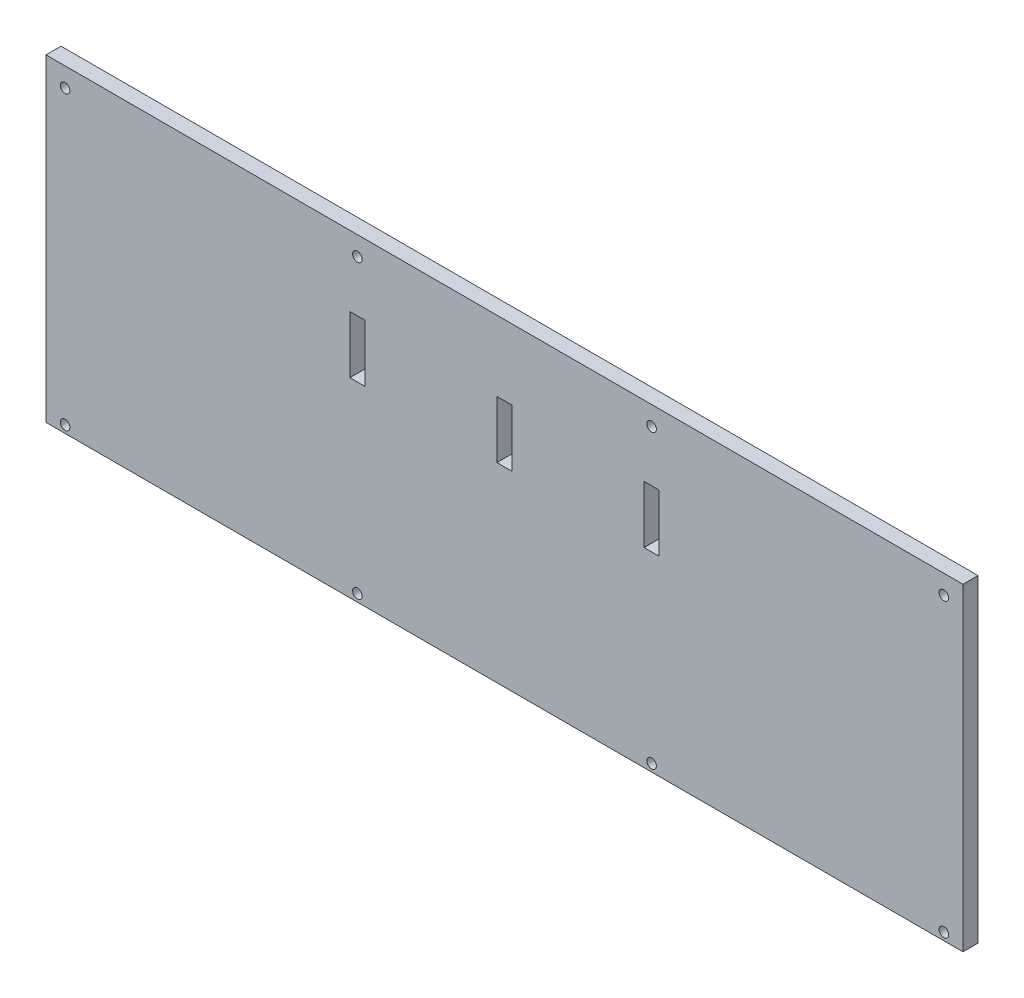
ISO-10303-21;
HEADER;
FILE_DESCRIPTION(('STEP AP214'),'2;1');
FILE_NAME('part.step','',(''),(''),'','','');
FILE_SCHEMA(('AUTOMOTIVE_DESIGN { 1 0 10303 214 1 1 1 1 }'));
ENDSEC;
DATA;
#1=APPLICATION_CONTEXT('core data for automotive mechanical design processes');
#2=APPLICATION_PROTOCOL_DEFINITION('international standard','automotive_design',2000,#1);
#3=PRODUCT_CONTEXT('',#1,'mechanical');
#4=PRODUCT('Part','Part','',(#3));
#5=PRODUCT_RELATED_PRODUCT_CATEGORY('part','',(#4));
#6=PRODUCT_DEFINITION_FORMATION('','',#4);
#7=PRODUCT_DEFINITION_CONTEXT('part definition',#1,'design');
#8=PRODUCT_DEFINITION('design','',#6,#7);
#9=PRODUCT_DEFINITION_SHAPE('','',#8);
#10=(LENGTH_UNIT() NAMED_UNIT(*) SI_UNIT(.MILLI.,.METRE.));
#11=(NAMED_UNIT(*) PLANE_ANGLE_UNIT() SI_UNIT($,.RADIAN.));
#12=(NAMED_UNIT(*) SI_UNIT($,.STERADIAN.) SOLID_ANGLE_UNIT());
#13=UNCERTAINTY_MEASURE_WITH_UNIT(LENGTH_MEASURE(1.E-05),#10,'distance_accuracy_value','');
#14=(GEOMETRIC_REPRESENTATION_CONTEXT(3) GLOBAL_UNCERTAINTY_ASSIGNED_CONTEXT((#13)) GLOBAL_UNIT_ASSIGNED_CONTEXT((#10,
#11,#12)) REPRESENTATION_CONTEXT('',''));
#15=CARTESIAN_POINT('',(0.,0.,0.));
#16=DIRECTION('',(0.,0.,1.));
#17=DIRECTION('',(1.,0.,0.));
#18=AXIS2_PLACEMENT_3D('',#15,#16,#17);
#19=CARTESIAN_POINT('',(0.,0.,5.));
#20=DIRECTION('',(0.,0.,1.));
#21=DIRECTION('',(1.,0.,0.));
#22=AXIS2_PLACEMENT_3D('',#19,#20,#21);
#23=PLANE('',#22);
#24=DIRECTION('',(0.,-1.,0.));
#25=VECTOR('',#24,1.);
#26=CARTESIAN_POINT('',(304.800000000002,105.815007519216,5.));
#27=LINE('',#26,#25);
#28=CARTESIAN_POINT('',(304.8,0.,5.));
#29=VERTEX_POINT('',#28);
#30=CARTESIAN_POINT('',(304.800000000001,105.815007519216,5.));
#31=VERTEX_POINT('',#30);
#32=EDGE_CURVE('E289',#29,#31,#27,.F.);
#33=ORIENTED_EDGE('',*,*,#32,.T.);
#34=DIRECTION('',(1.,0.,0.));
#35=VECTOR('',#34,1.);
#36=CARTESIAN_POINT('',(0.,105.815007519216,5.));
#37=LINE('',#36,#35);
#38=CARTESIAN_POINT('',(0.,105.815007519216,5.));
#39=VERTEX_POINT('',#38);
#40=EDGE_CURVE('E284',#31,#39,#37,.F.);
#41=ORIENTED_EDGE('',*,*,#40,.T.);
#42=DIRECTION('',(0.,1.,0.));
#43=VECTOR('',#42,1.);
#44=CARTESIAN_POINT('',(0.,105.815007519216,5.));
#45=LINE('',#44,#43);
#46=CARTESIAN_POINT('',(0.,0.,5.));
#47=VERTEX_POINT('',#46);
#48=EDGE_CURVE('E280',#39,#47,#45,.F.);
#49=ORIENTED_EDGE('',*,*,#48,.T.);
#50=DIRECTION('',(1.,0.,0.));
#51=VECTOR('',#50,1.);
#52=CARTESIAN_POINT('',(0.,0.,5.));
#53=LINE('',#52,#51);
#54=EDGE_CURVE('E180',#47,#29,#53,.T.);
#55=ORIENTED_EDGE('',*,*,#54,.T.);
#56=EDGE_LOOP('',(#33,#41,#49,#55));
#57=FACE_BOUND('',#56,.T.);
#58=CARTESIAN_POINT('',(6.34999999999991,99.4650075192159,5.));
#59=DIRECTION('',(0.,0.,1.));
#60=DIRECTION('',(1.,0.,0.));
#61=AXIS2_PLACEMENT_3D('',#58,#59,#60);
#62=CIRCLE('',#61,1.58750000000003);
#63=CARTESIAN_POINT('',(7.93749999999994,99.4650075192159,5.));
#64=VERTEX_POINT('',#63);
#65=EDGE_CURVE('E177',#64,#64,#62,.F.);
#66=ORIENTED_EDGE('',*,*,#65,.T.);
#67=EDGE_LOOP('',(#66));
#68=FACE_BOUND('',#67,.T.);
#69=CARTESIAN_POINT('',(6.34999999999994,2.49999999999995,5.));
#70=DIRECTION('',(0.,0.,1.));
#71=DIRECTION('',(1.,0.,0.));
#72=AXIS2_PLACEMENT_3D('',#69,#70,#71);
#73=CIRCLE('',#72,1.58749999999994);
#74=CARTESIAN_POINT('',(7.93749999999988,2.49999999999995,5.));
#75=VERTEX_POINT('',#74);
#76=EDGE_CURVE('E181',#75,#75,#73,.F.);
#77=ORIENTED_EDGE('',*,*,#76,.T.);
#78=EDGE_LOOP('',(#77));
#79=FACE_BOUND('',#78,.T.);
#80=CARTESIAN_POINT('',(103.505,2.49999999999995,5.));
#81=DIRECTION('',(0.,0.,1.));
#82=DIRECTION('',(1.,0.,0.));
#83=AXIS2_PLACEMENT_3D('',#80,#81,#82);
#84=CIRCLE('',#83,1.58750000000001);
#85=CARTESIAN_POINT('',(105.0925,2.49999999999995,5.));
#86=VERTEX_POINT('',#85);
#87=EDGE_CURVE('E184',#86,#86,#84,.F.);
#88=ORIENTED_EDGE('',*,*,#87,.T.);
#89=EDGE_LOOP('',(#88));
#90=FACE_BOUND('',#89,.T.);
#91=CARTESIAN_POINT('',(103.505,99.4650075192159,5.));
#92=DIRECTION('',(0.,0.,1.));
#93=DIRECTION('',(1.,0.,0.));
#94=AXIS2_PLACEMENT_3D('',#91,#92,#93);
#95=CIRCLE('',#94,1.58749999999999);
#96=CARTESIAN_POINT('',(105.0925,99.4650075192159,5.));
#97=VERTEX_POINT('',#96);
#98=EDGE_CURVE('E187',#97,#97,#95,.F.);
#99=ORIENTED_EDGE('',*,*,#98,.T.);
#100=EDGE_LOOP('',(#99));
#101=FACE_BOUND('',#100,.T.);
#102=CARTESIAN_POINT('',(201.295,99.4650075192159,5.));
#103=DIRECTION('',(0.,0.,1.));
#104=DIRECTION('',(1.,0.,0.));
#105=AXIS2_PLACEMENT_3D('',#102,#103,#104);
#106=CIRCLE('',#105,1.58750000000002);
#107=CARTESIAN_POINT('',(202.8825,99.4650075192159,5.));
#108=VERTEX_POINT('',#107);
#109=EDGE_CURVE('E190',#108,#108,#106,.F.);
#110=ORIENTED_EDGE('',*,*,#109,.T.);
#111=EDGE_LOOP('',(#110));
#112=FACE_BOUND('',#111,.T.);
#113=CARTESIAN_POINT('',(201.295,2.49999999999996,5.));
#114=DIRECTION('',(0.,0.,1.));
#115=DIRECTION('',(1.,0.,0.));
#116=AXIS2_PLACEMENT_3D('',#113,#114,#115);
#117=CIRCLE('',#116,1.58750000000002);
#118=CARTESIAN_POINT('',(202.8825,2.49999999999996,5.));
#119=VERTEX_POINT('',#118);
#120=EDGE_CURVE('E193',#119,#119,#117,.F.);
#121=ORIENTED_EDGE('',*,*,#120,.T.);
#122=EDGE_LOOP('',(#121));
#123=FACE_BOUND('',#122,.T.);
#124=CARTESIAN_POINT('',(298.45,2.49999999999998,5.));
#125=DIRECTION('',(0.,0.,1.));
#126=DIRECTION('',(1.,0.,0.));
#127=AXIS2_PLACEMENT_3D('',#124,#125,#126);
#128=CIRCLE('',#127,1.58750000000002);
#129=CARTESIAN_POINT('',(300.0375,2.49999999999998,5.));
#130=VERTEX_POINT('',#129);
#131=EDGE_CURVE('E195',#130,#130,#128,.F.);
#132=ORIENTED_EDGE('',*,*,#131,.T.);
#133=EDGE_LOOP('',(#132));
#134=FACE_BOUND('',#133,.T.);
#135=CARTESIAN_POINT('',(298.45,99.4650075192159,5.));
#136=DIRECTION('',(0.,0.,1.));
#137=DIRECTION('',(1.,0.,0.));
#138=AXIS2_PLACEMENT_3D('',#135,#136,#137);
#139=CIRCLE('',#138,1.58750000000002);
#140=CARTESIAN_POINT('',(300.0375,99.4650075192159,5.));
#141=VERTEX_POINT('',#140);
#142=EDGE_CURVE('E19',#141,#141,#139,.F.);
#143=ORIENTED_EDGE('',*,*,#142,.T.);
#144=EDGE_LOOP('',(#143));
#145=FACE_BOUND('',#144,.T.);
#146=DIRECTION('',(0.,1.,0.));
#147=VECTOR('',#146,1.);
#148=CARTESIAN_POINT('',(198.795,82.4299924807879,5.));
#149=LINE('',#148,#147);
#150=CARTESIAN_POINT('',(198.795,63.3799924807879,5.));
#151=VERTEX_POINT('',#150);
#152=CARTESIAN_POINT('',(198.795,82.4299924807879,5.));
#153=VERTEX_POINT('',#152);
#154=EDGE_CURVE('E228',#151,#153,#149,.T.);
#155=ORIENTED_EDGE('',*,*,#154,.T.);
#156=DIRECTION('',(1.,0.,0.));
#157=VECTOR('',#156,1.);
#158=CARTESIAN_POINT('',(203.795,82.4299924807879,5.));
#159=LINE('',#158,#157);
#160=CARTESIAN_POINT('',(203.795,82.4299924807879,5.));
#161=VERTEX_POINT('',#160);
#162=EDGE_CURVE('E223',#153,#161,#159,.T.);
#163=ORIENTED_EDGE('',*,*,#162,.T.);
#164=DIRECTION('',(0.,1.,0.));
#165=VECTOR('',#164,1.);
#166=CARTESIAN_POINT('',(203.795,82.4299924807879,5.));
#167=LINE('',#166,#165);
#168=CARTESIAN_POINT('',(203.795,63.3799924807879,5.));
#169=VERTEX_POINT('',#168);
#170=EDGE_CURVE('E218',#161,#169,#167,.F.);
#171=ORIENTED_EDGE('',*,*,#170,.T.);
#172=DIRECTION('',(1.,0.,0.));
#173=VECTOR('',#172,1.);
#174=CARTESIAN_POINT('',(203.795,63.3799924807879,5.));
#175=LINE('',#174,#173);
#176=EDGE_CURVE('E204',#169,#151,#175,.F.);
#177=ORIENTED_EDGE('',*,*,#176,.T.);
#178=EDGE_LOOP('',(#155,#163,#171,#177));
#179=FACE_BOUND('',#178,.T.);
#180=DIRECTION('',(1.,0.,0.));
#181=VECTOR('',#180,1.);
#182=CARTESIAN_POINT('',(105.995,63.3799924807879,5.));
#183=LINE('',#182,#181);
#184=CARTESIAN_POINT('',(105.995,63.3799924807879,5.));
#185=VERTEX_POINT('',#184);
#186=CARTESIAN_POINT('',(100.995,63.3799924807879,5.));
#187=VERTEX_POINT('',#186);
#188=EDGE_CURVE('E249',#185,#187,#183,.F.);
#189=ORIENTED_EDGE('',*,*,#188,.T.);
#190=DIRECTION('',(0.,1.,0.));
#191=VECTOR('',#190,1.);
#192=CARTESIAN_POINT('',(100.995,82.4299924807879,5.));
#193=LINE('',#192,#191);
#194=CARTESIAN_POINT('',(100.995,82.4299924807879,5.));
#195=VERTEX_POINT('',#194);
#196=EDGE_CURVE('E244',#187,#195,#193,.T.);
#197=ORIENTED_EDGE('',*,*,#196,.T.);
#198=DIRECTION('',(1.,0.,0.));
#199=VECTOR('',#198,1.);
#200=CARTESIAN_POINT('',(105.995,82.4299924807879,5.));
#201=LINE('',#200,#199);
#202=CARTESIAN_POINT('',(105.995,82.4299924807879,5.));
#203=VERTEX_POINT('',#202);
#204=EDGE_CURVE('E239',#195,#203,#201,.T.);
#205=ORIENTED_EDGE('',*,*,#204,.T.);
#206=DIRECTION('',(0.,1.,0.));
#207=VECTOR('',#206,1.);
#208=CARTESIAN_POINT('',(105.995,82.4299924807879,5.));
#209=LINE('',#208,#207);
#210=EDGE_CURVE('E233',#203,#185,#209,.F.);
#211=ORIENTED_EDGE('',*,*,#210,.T.);
#212=EDGE_LOOP('',(#189,#197,#205,#211));
#213=FACE_BOUND('',#212,.T.);
#214=DIRECTION('',(1.,0.,0.));
#215=VECTOR('',#214,1.);
#216=CARTESIAN_POINT('',(154.895,63.3799924807879,5.));
#217=LINE('',#216,#215);
#218=CARTESIAN_POINT('',(154.895,63.3799924807879,5.));
#219=VERTEX_POINT('',#218);
#220=CARTESIAN_POINT('',(149.895,63.3799924807879,5.));
#221=VERTEX_POINT('',#220);
#222=EDGE_CURVE('E129',#219,#221,#217,.F.);
#223=ORIENTED_EDGE('',*,*,#222,.T.);
#224=DIRECTION('',(0.,1.,0.));
#225=VECTOR('',#224,1.);
#226=CARTESIAN_POINT('',(149.895,82.4299924807879,5.));
#227=LINE('',#226,#225);
#228=CARTESIAN_POINT('',(149.895,82.4299924807879,5.));
#229=VERTEX_POINT('',#228);
#230=EDGE_CURVE('E126',#221,#229,#227,.T.);
#231=ORIENTED_EDGE('',*,*,#230,.T.);
#232=DIRECTION('',(1.,0.,0.));
#233=VECTOR('',#232,1.);
#234=CARTESIAN_POINT('',(154.895,82.4299924807879,5.));
#235=LINE('',#234,#233);
#236=CARTESIAN_POINT('',(154.895,82.4299924807879,5.));
#237=VERTEX_POINT('',#236);
#238=EDGE_CURVE('E257',#229,#237,#235,.T.);
#239=ORIENTED_EDGE('',*,*,#238,.T.);
#240=DIRECTION('',(0.,1.,0.));
#241=VECTOR('',#240,1.);
#242=CARTESIAN_POINT('',(154.895,82.4299924807879,5.));
#243=LINE('',#242,#241);
#244=EDGE_CURVE('E131',#237,#219,#243,.F.);
#245=ORIENTED_EDGE('',*,*,#244,.T.);
#246=EDGE_LOOP('',(#223,#231,#239,#245));
#247=FACE_BOUND('',#246,.T.);
#248=ADVANCED_FACE('F16',(#57,#68,#79,#90,#101,#112,#123,#134,#145,#179,#213,#247),#23,.T.);
#249=CARTESIAN_POINT('',(154.895,63.3799924807879,5.));
#250=DIRECTION('',(0.,-1.,0.));
#251=DIRECTION('',(0.,0.,-1.));
#252=AXIS2_PLACEMENT_3D('',#249,#250,#251);
#253=PLANE('',#252);
#254=DIRECTION('',(0.,0.,1.));
#255=VECTOR('',#254,1.);
#256=CARTESIAN_POINT('',(149.895,63.3799924807879,5.));
#257=LINE('',#256,#255);
#258=CARTESIAN_POINT('',(149.895,63.3799924807879,0.));
#259=VERTEX_POINT('',#258);
#260=EDGE_CURVE('E136',#259,#221,#257,.T.);
#261=ORIENTED_EDGE('',*,*,#260,.T.);
#262=ORIENTED_EDGE('',*,*,#222,.F.);
#263=DIRECTION('',(0.,0.,-1.));
#264=VECTOR('',#263,1.);
#265=CARTESIAN_POINT('',(154.895,63.3799924807879,5.));
#266=LINE('',#265,#264);
#267=CARTESIAN_POINT('',(154.895,63.3799924807879,0.));
#268=VERTEX_POINT('',#267);
#269=EDGE_CURVE('E251',#219,#268,#266,.T.);
#270=ORIENTED_EDGE('',*,*,#269,.T.);
#271=DIRECTION('',(1.,0.,0.));
#272=VECTOR('',#271,1.);
#273=CARTESIAN_POINT('',(0.,63.3799924807879,0.));
#274=LINE('',#273,#272);
#275=EDGE_CURVE('E147',#268,#259,#274,.F.);
#276=ORIENTED_EDGE('',*,*,#275,.T.);
#277=EDGE_LOOP('',(#261,#262,#270,#276));
#278=FACE_BOUND('',#277,.T.);
#279=ADVANCED_FACE('F146',(#278),#253,.F.);
#280=CARTESIAN_POINT('',(149.895,82.4299924807879,5.));
#281=DIRECTION('',(-1.,0.,0.));
#282=DIRECTION('',(0.,0.,1.));
#283=AXIS2_PLACEMENT_3D('',#280,#281,#282);
#284=PLANE('',#283);
#285=DIRECTION('',(0.,0.,1.));
#286=VECTOR('',#285,1.);
#287=CARTESIAN_POINT('',(149.895,82.4299924807879,5.));
#288=LINE('',#287,#286);
#289=CARTESIAN_POINT('',(149.895,82.4299924807879,0.));
#290=VERTEX_POINT('',#289);
#291=EDGE_CURVE('E143',#290,#229,#288,.T.);
#292=ORIENTED_EDGE('',*,*,#291,.T.);
#293=ORIENTED_EDGE('',*,*,#230,.F.);
#294=ORIENTED_EDGE('',*,*,#260,.F.);
#295=DIRECTION('',(0.,1.,0.));
#296=VECTOR('',#295,1.);
#297=CARTESIAN_POINT('',(149.895,0.,0.));
#298=LINE('',#297,#296);
#299=EDGE_CURVE('E269',#259,#290,#298,.T.);
#300=ORIENTED_EDGE('',*,*,#299,.T.);
#301=EDGE_LOOP('',(#292,#293,#294,#300));
#302=FACE_BOUND('',#301,.T.);
#303=ADVANCED_FACE('F140',(#302),#284,.F.);
#304=CARTESIAN_POINT('',(154.895,82.4299924807879,5.));
#305=DIRECTION('',(0.,1.,0.));
#306=DIRECTION('',(0.,0.,1.));
#307=AXIS2_PLACEMENT_3D('',#304,#305,#306);
#308=PLANE('',#307);
#309=DIRECTION('',(0.,0.,-1.));
#310=VECTOR('',#309,1.);
#311=CARTESIAN_POINT('',(154.895,82.4299924807879,5.));
#312=LINE('',#311,#310);
#313=CARTESIAN_POINT('',(154.895,82.4299924807879,0.));
#314=VERTEX_POINT('',#313);
#315=EDGE_CURVE('E254',#314,#237,#312,.F.);
#316=ORIENTED_EDGE('',*,*,#315,.T.);
#317=ORIENTED_EDGE('',*,*,#238,.F.);
#318=ORIENTED_EDGE('',*,*,#291,.F.);
#319=DIRECTION('',(1.,0.,0.));
#320=VECTOR('',#319,1.);
#321=CARTESIAN_POINT('',(0.,82.4299924807879,0.));
#322=LINE('',#321,#320);
#323=EDGE_CURVE('E266',#290,#314,#322,.T.);
#324=ORIENTED_EDGE('',*,*,#323,.T.);
#325=EDGE_LOOP('',(#316,#317,#318,#324));
#326=FACE_BOUND('',#325,.T.);
#327=ADVANCED_FACE('F264',(#326),#308,.F.);
#328=CARTESIAN_POINT('',(154.895,82.4299924807879,5.));
#329=DIRECTION('',(1.,0.,0.));
#330=DIRECTION('',(0.,0.,-1.));
#331=AXIS2_PLACEMENT_3D('',#328,#329,#330);
#332=PLANE('',#331);
#333=ORIENTED_EDGE('',*,*,#269,.F.);
#334=ORIENTED_EDGE('',*,*,#244,.F.);
#335=ORIENTED_EDGE('',*,*,#315,.F.);
#336=DIRECTION('',(0.,1.,0.));
#337=VECTOR('',#336,1.);
#338=CARTESIAN_POINT('',(154.895,0.,0.));
#339=LINE('',#338,#337);
#340=EDGE_CURVE('E268',#314,#268,#339,.F.);
#341=ORIENTED_EDGE('',*,*,#340,.T.);
#342=EDGE_LOOP('',(#333,#334,#335,#341));
#343=FACE_BOUND('',#342,.T.);
#344=ADVANCED_FACE('F260',(#343),#332,.F.);
#345=CARTESIAN_POINT('',(105.995,63.3799924807879,5.));
#346=DIRECTION('',(0.,-1.,0.));
#347=DIRECTION('',(0.,0.,-1.));
#348=AXIS2_PLACEMENT_3D('',#345,#346,#347);
#349=PLANE('',#348);
#350=DIRECTION('',(0.,0.,1.));
#351=VECTOR('',#350,1.);
#352=CARTESIAN_POINT('',(100.995,63.3799924807879,5.));
#353=LINE('',#352,#351);
#354=CARTESIAN_POINT('',(100.995,63.3799924807879,0.));
#355=VERTEX_POINT('',#354);
#356=EDGE_CURVE('E246',#355,#187,#353,.T.);
#357=ORIENTED_EDGE('',*,*,#356,.T.);
#358=ORIENTED_EDGE('',*,*,#188,.F.);
#359=DIRECTION('',(0.,0.,-1.));
#360=VECTOR('',#359,1.);
#361=CARTESIAN_POINT('',(105.995,63.3799924807879,5.));
#362=LINE('',#361,#360);
#363=CARTESIAN_POINT('',(105.995,63.3799924807879,0.));
#364=VERTEX_POINT('',#363);
#365=EDGE_CURVE('E230',#185,#364,#362,.T.);
#366=ORIENTED_EDGE('',*,*,#365,.T.);
#367=DIRECTION('',(1.,0.,0.));
#368=VECTOR('',#367,1.);
#369=CARTESIAN_POINT('',(0.,63.3799924807879,0.));
#370=LINE('',#369,#368);
#371=EDGE_CURVE('E271',#364,#355,#370,.F.);
#372=ORIENTED_EDGE('',*,*,#371,.T.);
#373=EDGE_LOOP('',(#357,#358,#366,#372));
#374=FACE_BOUND('',#373,.T.);
#375=ADVANCED_FACE('F334',(#374),#349,.F.);
#376=CARTESIAN_POINT('',(100.995,82.4299924807879,5.));
#377=DIRECTION('',(-1.,0.,0.));
#378=DIRECTION('',(0.,0.,1.));
#379=AXIS2_PLACEMENT_3D('',#376,#377,#378);
#380=PLANE('',#379);
#381=DIRECTION('',(0.,0.,1.));
#382=VECTOR('',#381,1.);
#383=CARTESIAN_POINT('',(100.995,82.4299924807879,5.));
#384=LINE('',#383,#382);
#385=CARTESIAN_POINT('',(100.995,82.4299924807879,0.));
#386=VERTEX_POINT('',#385);
#387=EDGE_CURVE('E241',#386,#195,#384,.T.);
#388=ORIENTED_EDGE('',*,*,#387,.T.);
#389=ORIENTED_EDGE('',*,*,#196,.F.);
#390=ORIENTED_EDGE('',*,*,#356,.F.);
#391=DIRECTION('',(0.,1.,0.));
#392=VECTOR('',#391,1.);
#393=CARTESIAN_POINT('',(100.995,0.,0.));
#394=LINE('',#393,#392);
#395=EDGE_CURVE('E330',#355,#386,#394,.T.);
#396=ORIENTED_EDGE('',*,*,#395,.T.);
#397=EDGE_LOOP('',(#388,#389,#390,#396));
#398=FACE_BOUND('',#397,.T.);
#399=ADVANCED_FACE('F341',(#398),#380,.F.);
#400=CARTESIAN_POINT('',(105.995,82.4299924807879,5.));
#401=DIRECTION('',(0.,1.,0.));
#402=DIRECTION('',(0.,0.,1.));
#403=AXIS2_PLACEMENT_3D('',#400,#401,#402);
#404=PLANE('',#403);
#405=DIRECTION('',(0.,0.,-1.));
#406=VECTOR('',#405,1.);
#407=CARTESIAN_POINT('',(105.995,82.4299924807879,5.));
#408=LINE('',#407,#406);
#409=CARTESIAN_POINT('',(105.995,82.4299924807879,0.));
#410=VERTEX_POINT('',#409);
#411=EDGE_CURVE('E236',#410,#203,#408,.F.);
#412=ORIENTED_EDGE('',*,*,#411,.T.);
#413=ORIENTED_EDGE('',*,*,#204,.F.);
#414=ORIENTED_EDGE('',*,*,#387,.F.);
#415=DIRECTION('',(1.,0.,0.));
#416=VECTOR('',#415,1.);
#417=CARTESIAN_POINT('',(0.,82.4299924807879,0.));
#418=LINE('',#417,#416);
#419=EDGE_CURVE('E327',#386,#410,#418,.T.);
#420=ORIENTED_EDGE('',*,*,#419,.T.);
#421=EDGE_LOOP('',(#412,#413,#414,#420));
#422=FACE_BOUND('',#421,.T.);
#423=ADVANCED_FACE('F347',(#422),#404,.F.);
#424=CARTESIAN_POINT('',(105.995,82.4299924807879,5.));
#425=DIRECTION('',(1.,0.,0.));
#426=DIRECTION('',(0.,0.,-1.));
#427=AXIS2_PLACEMENT_3D('',#424,#425,#426);
#428=PLANE('',#427);
#429=ORIENTED_EDGE('',*,*,#365,.F.);
#430=ORIENTED_EDGE('',*,*,#210,.F.);
#431=ORIENTED_EDGE('',*,*,#411,.F.);
#432=DIRECTION('',(0.,1.,0.));
#433=VECTOR('',#432,1.);
#434=CARTESIAN_POINT('',(105.995,0.,0.));
#435=LINE('',#434,#433);
#436=EDGE_CURVE('E324',#410,#364,#435,.F.);
#437=ORIENTED_EDGE('',*,*,#436,.T.);
#438=EDGE_LOOP('',(#429,#430,#431,#437));
#439=FACE_BOUND('',#438,.T.);
#440=ADVANCED_FACE('F349',(#439),#428,.F.);
#441=CARTESIAN_POINT('',(198.795,82.4299924807879,5.));
#442=DIRECTION('',(-1.,0.,0.));
#443=DIRECTION('',(0.,0.,1.));
#444=AXIS2_PLACEMENT_3D('',#441,#442,#443);
#445=PLANE('',#444);
#446=DIRECTION('',(0.,0.,1.));
#447=VECTOR('',#446,1.);
#448=CARTESIAN_POINT('',(198.795,82.4299924807879,5.));
#449=LINE('',#448,#447);
#450=CARTESIAN_POINT('',(198.795,82.4299924807879,0.));
#451=VERTEX_POINT('',#450);
#452=EDGE_CURVE('E225',#451,#153,#449,.T.);
#453=ORIENTED_EDGE('',*,*,#452,.T.);
#454=ORIENTED_EDGE('',*,*,#154,.F.);
#455=DIRECTION('',(0.,0.,-1.));
#456=VECTOR('',#455,1.);
#457=CARTESIAN_POINT('',(198.795,63.3799924807879,5.));
#458=LINE('',#457,#456);
#459=CARTESIAN_POINT('',(198.795,63.3799924807879,0.));
#460=VERTEX_POINT('',#459);
#461=EDGE_CURVE('E200',#151,#460,#458,.T.);
#462=ORIENTED_EDGE('',*,*,#461,.T.);
#463=DIRECTION('',(0.,1.,0.));
#464=VECTOR('',#463,1.);
#465=CARTESIAN_POINT('',(198.795,0.,0.));
#466=LINE('',#465,#464);
#467=EDGE_CURVE('E322',#460,#451,#466,.T.);
#468=ORIENTED_EDGE('',*,*,#467,.T.);
#469=EDGE_LOOP('',(#453,#454,#462,#468));
#470=FACE_BOUND('',#469,.T.);
#471=ADVANCED_FACE('F351',(#470),#445,.F.);
#472=CARTESIAN_POINT('',(203.795,82.4299924807879,5.));
#473=DIRECTION('',(0.,1.,0.));
#474=DIRECTION('',(0.,0.,1.));
#475=AXIS2_PLACEMENT_3D('',#472,#473,#474);
#476=PLANE('',#475);
#477=DIRECTION('',(0.,0.,-1.));
#478=VECTOR('',#477,1.);
#479=CARTESIAN_POINT('',(203.795,82.4299924807879,5.));
#480=LINE('',#479,#478);
#481=CARTESIAN_POINT('',(203.795,82.4299924807879,0.));
#482=VERTEX_POINT('',#481);
#483=EDGE_CURVE('E220',#482,#161,#480,.F.);
#484=ORIENTED_EDGE('',*,*,#483,.T.);
#485=ORIENTED_EDGE('',*,*,#162,.F.);
#486=ORIENTED_EDGE('',*,*,#452,.F.);
#487=DIRECTION('',(1.,0.,0.));
#488=VECTOR('',#487,1.);
#489=CARTESIAN_POINT('',(0.,82.4299924807879,0.));
#490=LINE('',#489,#488);
#491=EDGE_CURVE('E319',#451,#482,#490,.T.);
#492=ORIENTED_EDGE('',*,*,#491,.T.);
#493=EDGE_LOOP('',(#484,#485,#486,#492));
#494=FACE_BOUND('',#493,.T.);
#495=ADVANCED_FACE('F358',(#494),#476,.F.);
#496=CARTESIAN_POINT('',(203.795,82.4299924807879,5.));
#497=DIRECTION('',(1.,0.,0.));
#498=DIRECTION('',(0.,0.,-1.));
#499=AXIS2_PLACEMENT_3D('',#496,#497,#498);
#500=PLANE('',#499);
#501=DIRECTION('',(0.,0.,-1.));
#502=VECTOR('',#501,1.);
#503=CARTESIAN_POINT('',(203.795,63.3799924807879,5.));
#504=LINE('',#503,#502);
#505=CARTESIAN_POINT('',(203.795,63.3799924807879,0.));
#506=VERTEX_POINT('',#505);
#507=EDGE_CURVE('E211',#506,#169,#504,.F.);
#508=ORIENTED_EDGE('',*,*,#507,.T.);
#509=ORIENTED_EDGE('',*,*,#170,.F.);
#510=ORIENTED_EDGE('',*,*,#483,.F.);
#511=DIRECTION('',(0.,1.,0.));
#512=VECTOR('',#511,1.);
#513=CARTESIAN_POINT('',(203.795,0.,0.));
#514=LINE('',#513,#512);
#515=EDGE_CURVE('E316',#482,#506,#514,.F.);
#516=ORIENTED_EDGE('',*,*,#515,.T.);
#517=EDGE_LOOP('',(#508,#509,#510,#516));
#518=FACE_BOUND('',#517,.T.);
#519=ADVANCED_FACE('F411',(#518),#500,.F.);
#520=CARTESIAN_POINT('',(203.795,63.3799924807879,5.));
#521=DIRECTION('',(0.,-1.,0.));
#522=DIRECTION('',(0.,0.,-1.));
#523=AXIS2_PLACEMENT_3D('',#520,#521,#522);
#524=PLANE('',#523);
#525=ORIENTED_EDGE('',*,*,#461,.F.);
#526=ORIENTED_EDGE('',*,*,#176,.F.);
#527=ORIENTED_EDGE('',*,*,#507,.F.);
#528=DIRECTION('',(1.,0.,0.));
#529=VECTOR('',#528,1.);
#530=CARTESIAN_POINT('',(0.,63.3799924807879,0.));
#531=LINE('',#530,#529);
#532=EDGE_CURVE('E176',#506,#460,#531,.F.);
#533=ORIENTED_EDGE('',*,*,#532,.T.);
#534=EDGE_LOOP('',(#525,#526,#527,#533));
#535=FACE_BOUND('',#534,.T.);
#536=ADVANCED_FACE('F407',(#535),#524,.F.);
#537=CARTESIAN_POINT('',(298.45,99.4650075192159,0.));
#538=DIRECTION('',(0.,0.,1.));
#539=DIRECTION('',(1.,0.,0.));
#540=AXIS2_PLACEMENT_3D('',#537,#538,#539);
#541=CYLINDRICAL_SURFACE('',#540,1.58750000000002);
#542=CARTESIAN_POINT('',(298.45,99.4650075192159,0.));
#543=DIRECTION('',(0.,0.,1.));
#544=DIRECTION('',(1.,0.,0.));
#545=AXIS2_PLACEMENT_3D('',#542,#543,#544);
#546=CIRCLE('',#545,1.58750000000002);
#547=CARTESIAN_POINT('',(300.0375,99.4650075192159,0.));
#548=VERTEX_POINT('',#547);
#549=EDGE_CURVE('E173',#548,#548,#546,.F.);
#550=ORIENTED_EDGE('',*,*,#549,.T.);
#551=EDGE_LOOP('',(#550));
#552=FACE_BOUND('',#551,.T.);
#553=ORIENTED_EDGE('',*,*,#142,.F.);
#554=EDGE_LOOP('',(#553));
#555=FACE_BOUND('',#554,.T.);
#556=ADVANCED_FACE('F403',(#552,#555),#541,.F.);
#557=CARTESIAN_POINT('',(298.45,2.49999999999998,0.));
#558=DIRECTION('',(0.,0.,1.));
#559=DIRECTION('',(1.,0.,0.));
#560=AXIS2_PLACEMENT_3D('',#557,#558,#559);
#561=CYLINDRICAL_SURFACE('',#560,1.58750000000002);
#562=CARTESIAN_POINT('',(298.45,2.49999999999998,0.));
#563=DIRECTION('',(0.,0.,1.));
#564=DIRECTION('',(1.,0.,0.));
#565=AXIS2_PLACEMENT_3D('',#562,#563,#564);
#566=CIRCLE('',#565,1.58750000000002);
#567=CARTESIAN_POINT('',(300.0375,2.49999999999998,0.));
#568=VERTEX_POINT('',#567);
#569=EDGE_CURVE('E170',#568,#568,#566,.F.);
#570=ORIENTED_EDGE('',*,*,#569,.T.);
#571=EDGE_LOOP('',(#570));
#572=FACE_BOUND('',#571,.T.);
#573=ORIENTED_EDGE('',*,*,#131,.F.);
#574=EDGE_LOOP('',(#573));
#575=FACE_BOUND('',#574,.T.);
#576=ADVANCED_FACE('F399',(#572,#575),#561,.F.);
#577=CARTESIAN_POINT('',(201.295,2.49999999999996,0.));
#578=DIRECTION('',(0.,0.,1.));
#579=DIRECTION('',(1.,0.,0.));
#580=AXIS2_PLACEMENT_3D('',#577,#578,#579);
#581=CYLINDRICAL_SURFACE('',#580,1.58750000000002);
#582=CARTESIAN_POINT('',(201.295,2.49999999999996,0.));
#583=DIRECTION('',(0.,0.,1.));
#584=DIRECTION('',(1.,0.,0.));
#585=AXIS2_PLACEMENT_3D('',#582,#583,#584);
#586=CIRCLE('',#585,1.58750000000002);
#587=CARTESIAN_POINT('',(202.8825,2.49999999999996,0.));
#588=VERTEX_POINT('',#587);
#589=EDGE_CURVE('E167',#588,#588,#586,.F.);
#590=ORIENTED_EDGE('',*,*,#589,.T.);
#591=EDGE_LOOP('',(#590));
#592=FACE_BOUND('',#591,.T.);
#593=ORIENTED_EDGE('',*,*,#120,.F.);
#594=EDGE_LOOP('',(#593));
#595=FACE_BOUND('',#594,.T.);
#596=ADVANCED_FACE('F395',(#592,#595),#581,.F.);
#597=CARTESIAN_POINT('',(201.295,99.4650075192159,0.));
#598=DIRECTION('',(0.,0.,1.));
#599=DIRECTION('',(1.,0.,0.));
#600=AXIS2_PLACEMENT_3D('',#597,#598,#599);
#601=CYLINDRICAL_SURFACE('',#600,1.58750000000002);
#602=CARTESIAN_POINT('',(201.295,99.4650075192159,0.));
#603=DIRECTION('',(0.,0.,1.));
#604=DIRECTION('',(1.,0.,0.));
#605=AXIS2_PLACEMENT_3D('',#602,#603,#604);
#606=CIRCLE('',#605,1.58750000000002);
#607=CARTESIAN_POINT('',(202.8825,99.4650075192159,0.));
#608=VERTEX_POINT('',#607);
#609=EDGE_CURVE('E164',#608,#608,#606,.F.);
#610=ORIENTED_EDGE('',*,*,#609,.T.);
#611=EDGE_LOOP('',(#610));
#612=FACE_BOUND('',#611,.T.);
#613=ORIENTED_EDGE('',*,*,#109,.F.);
#614=EDGE_LOOP('',(#613));
#615=FACE_BOUND('',#614,.T.);
#616=ADVANCED_FACE('F391',(#612,#615),#601,.F.);
#617=CARTESIAN_POINT('',(103.505,99.4650075192159,0.));
#618=DIRECTION('',(0.,0.,1.));
#619=DIRECTION('',(1.,0.,0.));
#620=AXIS2_PLACEMENT_3D('',#617,#618,#619);
#621=CYLINDRICAL_SURFACE('',#620,1.58749999999999);
#622=CARTESIAN_POINT('',(103.505,99.4650075192159,0.));
#623=DIRECTION('',(0.,0.,1.));
#624=DIRECTION('',(1.,0.,0.));
#625=AXIS2_PLACEMENT_3D('',#622,#623,#624);
#626=CIRCLE('',#625,1.58749999999999);
#627=CARTESIAN_POINT('',(105.0925,99.4650075192159,0.));
#628=VERTEX_POINT('',#627);
#629=EDGE_CURVE('E161',#628,#628,#626,.F.);
#630=ORIENTED_EDGE('',*,*,#629,.T.);
#631=EDGE_LOOP('',(#630));
#632=FACE_BOUND('',#631,.T.);
#633=ORIENTED_EDGE('',*,*,#98,.F.);
#634=EDGE_LOOP('',(#633));
#635=FACE_BOUND('',#634,.T.);
#636=ADVANCED_FACE('F387',(#632,#635),#621,.F.);
#637=CARTESIAN_POINT('',(103.505,2.49999999999995,0.));
#638=DIRECTION('',(0.,0.,1.));
#639=DIRECTION('',(1.,0.,0.));
#640=AXIS2_PLACEMENT_3D('',#637,#638,#639);
#641=CYLINDRICAL_SURFACE('',#640,1.58750000000001);
#642=CARTESIAN_POINT('',(103.505,2.49999999999995,0.));
#643=DIRECTION('',(0.,0.,1.));
#644=DIRECTION('',(1.,0.,0.));
#645=AXIS2_PLACEMENT_3D('',#642,#643,#644);
#646=CIRCLE('',#645,1.58750000000001);
#647=CARTESIAN_POINT('',(105.0925,2.49999999999995,0.));
#648=VERTEX_POINT('',#647);
#649=EDGE_CURVE('E158',#648,#648,#646,.F.);
#650=ORIENTED_EDGE('',*,*,#649,.T.);
#651=EDGE_LOOP('',(#650));
#652=FACE_BOUND('',#651,.T.);
#653=ORIENTED_EDGE('',*,*,#87,.F.);
#654=EDGE_LOOP('',(#653));
#655=FACE_BOUND('',#654,.T.);
#656=ADVANCED_FACE('F383',(#652,#655),#641,.F.);
#657=CARTESIAN_POINT('',(6.34999999999994,2.49999999999995,0.));
#658=DIRECTION('',(0.,0.,1.));
#659=DIRECTION('',(1.,0.,0.));
#660=AXIS2_PLACEMENT_3D('',#657,#658,#659);
#661=CYLINDRICAL_SURFACE('',#660,1.58749999999994);
#662=CARTESIAN_POINT('',(6.34999999999994,2.49999999999995,0.));
#663=DIRECTION('',(0.,0.,1.));
#664=DIRECTION('',(1.,0.,0.));
#665=AXIS2_PLACEMENT_3D('',#662,#663,#664);
#666=CIRCLE('',#665,1.58749999999994);
#667=CARTESIAN_POINT('',(7.93749999999988,2.49999999999995,0.));
#668=VERTEX_POINT('',#667);
#669=EDGE_CURVE('E155',#668,#668,#666,.F.);
#670=ORIENTED_EDGE('',*,*,#669,.T.);
#671=EDGE_LOOP('',(#670));
#672=FACE_BOUND('',#671,.T.);
#673=ORIENTED_EDGE('',*,*,#76,.F.);
#674=EDGE_LOOP('',(#673));
#675=FACE_BOUND('',#674,.T.);
#676=ADVANCED_FACE('F379',(#672,#675),#661,.F.);
#677=CARTESIAN_POINT('',(6.34999999999991,99.4650075192159,0.));
#678=DIRECTION('',(0.,0.,1.));
#679=DIRECTION('',(1.,0.,0.));
#680=AXIS2_PLACEMENT_3D('',#677,#678,#679);
#681=CYLINDRICAL_SURFACE('',#680,1.58750000000003);
#682=CARTESIAN_POINT('',(6.34999999999991,99.4650075192159,0.));
#683=DIRECTION('',(0.,0.,1.));
#684=DIRECTION('',(1.,0.,0.));
#685=AXIS2_PLACEMENT_3D('',#682,#683,#684);
#686=CIRCLE('',#685,1.58750000000003);
#687=CARTESIAN_POINT('',(7.93749999999994,99.4650075192159,0.));
#688=VERTEX_POINT('',#687);
#689=EDGE_CURVE('E151',#688,#688,#686,.F.);
#690=ORIENTED_EDGE('',*,*,#689,.T.);
#691=EDGE_LOOP('',(#690));
#692=FACE_BOUND('',#691,.T.);
#693=ORIENTED_EDGE('',*,*,#65,.F.);
#694=EDGE_LOOP('',(#693));
#695=FACE_BOUND('',#694,.T.);
#696=ADVANCED_FACE('F376',(#692,#695),#681,.F.);
#697=CARTESIAN_POINT('',(0.,0.,5.));
#698=DIRECTION('',(0.,1.,0.));
#699=DIRECTION('',(0.,0.,1.));
#700=AXIS2_PLACEMENT_3D('',#697,#698,#699);
#701=PLANE('',#700);
#702=DIRECTION('',(0.,0.,1.));
#703=VECTOR('',#702,1.);
#704=CARTESIAN_POINT('',(304.8,0.,5.));
#705=LINE('',#704,#703);
#706=CARTESIAN_POINT('',(304.8,0.,0.));
#707=VERTEX_POINT('',#706);
#708=EDGE_CURVE('E290',#707,#29,#705,.T.);
#709=ORIENTED_EDGE('',*,*,#708,.T.);
#710=ORIENTED_EDGE('',*,*,#54,.F.);
#711=DIRECTION('',(0.,0.,1.));
#712=VECTOR('',#711,1.);
#713=CARTESIAN_POINT('',(0.,0.,5.));
#714=LINE('',#713,#712);
#715=CARTESIAN_POINT('',(0.,0.,0.));
#716=VERTEX_POINT('',#715);
#717=EDGE_CURVE('E277',#47,#716,#714,.F.);
#718=ORIENTED_EDGE('',*,*,#717,.T.);
#719=DIRECTION('',(1.,0.,0.));
#720=VECTOR('',#719,1.);
#721=CARTESIAN_POINT('',(0.,0.,0.));
#722=LINE('',#721,#720);
#723=EDGE_CURVE('E154',#716,#707,#722,.T.);
#724=ORIENTED_EDGE('',*,*,#723,.T.);
#725=EDGE_LOOP('',(#709,#710,#718,#724));
#726=FACE_BOUND('',#725,.T.);
#727=ADVANCED_FACE('F373',(#726),#701,.F.);
#728=CARTESIAN_POINT('',(304.800000000002,105.815007519216,5.));
#729=DIRECTION('',(-1.,0.,0.));
#730=DIRECTION('',(0.,-1.,0.));
#731=AXIS2_PLACEMENT_3D('',#728,#729,#730);
#732=PLANE('',#731);
#733=DIRECTION('',(0.,0.,-1.));
#734=VECTOR('',#733,1.);
#735=CARTESIAN_POINT('',(304.800000000002,105.815007519216,5.));
#736=LINE('',#735,#734);
#737=CARTESIAN_POINT('',(304.800000000001,105.815007519216,0.));
#738=VERTEX_POINT('',#737);
#739=EDGE_CURVE('E286',#738,#31,#736,.F.);
#740=ORIENTED_EDGE('',*,*,#739,.T.);
#741=ORIENTED_EDGE('',*,*,#32,.F.);
#742=ORIENTED_EDGE('',*,*,#708,.F.);
#743=DIRECTION('',(0.,1.,0.));
#744=VECTOR('',#743,1.);
#745=CARTESIAN_POINT('',(304.8,0.,0.));
#746=LINE('',#745,#744);
#747=EDGE_CURVE('E303',#707,#738,#746,.T.);
#748=ORIENTED_EDGE('',*,*,#747,.T.);
#749=EDGE_LOOP('',(#740,#741,#742,#748));
#750=FACE_BOUND('',#749,.T.);
#751=ADVANCED_FACE('F300',(#750),#732,.F.);
#752=CARTESIAN_POINT('',(0.,105.815007519216,5.));
#753=DIRECTION('',(0.,-1.,0.));
#754=DIRECTION('',(0.,0.,-1.));
#755=AXIS2_PLACEMENT_3D('',#752,#753,#754);
#756=PLANE('',#755);
#757=DIRECTION('',(0.,0.,1.));
#758=VECTOR('',#757,1.);
#759=CARTESIAN_POINT('',(0.,105.815007519216,5.));
#760=LINE('',#759,#758);
#761=CARTESIAN_POINT('',(0.,105.815007519216,0.));
#762=VERTEX_POINT('',#761);
#763=EDGE_CURVE('E33',#762,#39,#760,.T.);
#764=ORIENTED_EDGE('',*,*,#763,.T.);
#765=ORIENTED_EDGE('',*,*,#40,.F.);
#766=ORIENTED_EDGE('',*,*,#739,.F.);
#767=DIRECTION('',(1.,0.,0.));
#768=VECTOR('',#767,1.);
#769=CARTESIAN_POINT('',(0.,105.815007519216,0.));
#770=LINE('',#769,#768);
#771=EDGE_CURVE('E25',#738,#762,#770,.F.);
#772=ORIENTED_EDGE('',*,*,#771,.T.);
#773=EDGE_LOOP('',(#764,#765,#766,#772));
#774=FACE_BOUND('',#773,.T.);
#775=ADVANCED_FACE('F307',(#774),#756,.F.);
#776=CARTESIAN_POINT('',(0.,105.815007519216,5.));
#777=DIRECTION('',(1.,0.,0.));
#778=DIRECTION('',(0.,1.,0.));
#779=AXIS2_PLACEMENT_3D('',#776,#777,#778);
#780=PLANE('',#779);
#781=ORIENTED_EDGE('',*,*,#717,.F.);
#782=ORIENTED_EDGE('',*,*,#48,.F.);
#783=ORIENTED_EDGE('',*,*,#763,.F.);
#784=DIRECTION('',(0.,1.,0.));
#785=VECTOR('',#784,1.);
#786=CARTESIAN_POINT('',(0.,0.,0.));
#787=LINE('',#786,#785);
#788=EDGE_CURVE('E11',#762,#716,#787,.F.);
#789=ORIENTED_EDGE('',*,*,#788,.T.);
#790=EDGE_LOOP('',(#781,#782,#783,#789));
#791=FACE_BOUND('',#790,.T.);
#792=ADVANCED_FACE('F362',(#791),#780,.F.);
#793=CARTESIAN_POINT('',(0.,0.,0.));
#794=DIRECTION('',(0.,0.,1.));
#795=DIRECTION('',(1.,0.,0.));
#796=AXIS2_PLACEMENT_3D('',#793,#794,#795);
#797=PLANE('',#796);
#798=ORIENTED_EDGE('',*,*,#771,.F.);
#799=ORIENTED_EDGE('',*,*,#747,.F.);
#800=ORIENTED_EDGE('',*,*,#723,.F.);
#801=ORIENTED_EDGE('',*,*,#788,.F.);
#802=EDGE_LOOP('',(#798,#799,#800,#801));
#803=FACE_BOUND('',#802,.T.);
#804=ORIENTED_EDGE('',*,*,#689,.F.);
#805=EDGE_LOOP('',(#804));
#806=FACE_BOUND('',#805,.T.);
#807=ORIENTED_EDGE('',*,*,#669,.F.);
#808=EDGE_LOOP('',(#807));
#809=FACE_BOUND('',#808,.T.);
#810=ORIENTED_EDGE('',*,*,#649,.F.);
#811=EDGE_LOOP('',(#810));
#812=FACE_BOUND('',#811,.T.);
#813=ORIENTED_EDGE('',*,*,#629,.F.);
#814=EDGE_LOOP('',(#813));
#815=FACE_BOUND('',#814,.T.);
#816=ORIENTED_EDGE('',*,*,#609,.F.);
#817=EDGE_LOOP('',(#816));
#818=FACE_BOUND('',#817,.T.);
#819=ORIENTED_EDGE('',*,*,#589,.F.);
#820=EDGE_LOOP('',(#819));
#821=FACE_BOUND('',#820,.T.);
#822=ORIENTED_EDGE('',*,*,#569,.F.);
#823=EDGE_LOOP('',(#822));
#824=FACE_BOUND('',#823,.T.);
#825=ORIENTED_EDGE('',*,*,#549,.F.);
#826=EDGE_LOOP('',(#825));
#827=FACE_BOUND('',#826,.T.);
#828=ORIENTED_EDGE('',*,*,#515,.F.);
#829=ORIENTED_EDGE('',*,*,#491,.F.);
#830=ORIENTED_EDGE('',*,*,#467,.F.);
#831=ORIENTED_EDGE('',*,*,#532,.F.);
#832=EDGE_LOOP('',(#828,#829,#830,#831));
#833=FACE_BOUND('',#832,.T.);
#834=ORIENTED_EDGE('',*,*,#419,.F.);
#835=ORIENTED_EDGE('',*,*,#395,.F.);
#836=ORIENTED_EDGE('',*,*,#371,.F.);
#837=ORIENTED_EDGE('',*,*,#436,.F.);
#838=EDGE_LOOP('',(#834,#835,#836,#837));
#839=FACE_BOUND('',#838,.T.);
#840=ORIENTED_EDGE('',*,*,#323,.F.);
#841=ORIENTED_EDGE('',*,*,#299,.F.);
#842=ORIENTED_EDGE('',*,*,#275,.F.);
#843=ORIENTED_EDGE('',*,*,#340,.F.);
#844=EDGE_LOOP('',(#840,#841,#842,#843));
#845=FACE_BOUND('',#844,.T.);
#846=ADVANCED_FACE('F309',(#803,#806,#809,#812,#815,#818,#821,#824,#827,#833,#839,#845),#797,.F.);
#847=CLOSED_SHELL('',(#248,#279,#303,#327,#344,#375,#399,#423,#440,#471,#495,#519,#536,#556,
#576,#596,#616,#636,#656,#676,#696,#727,#751,#775,#792,#846));
#848=MANIFOLD_SOLID_BREP('B1',#847);
#849=ADVANCED_BREP_SHAPE_REPRESENTATION('',(#18,#848),#14);
#850=SHAPE_DEFINITION_REPRESENTATION(#9,#849);
ENDSEC;
END-ISO-10303-21;
